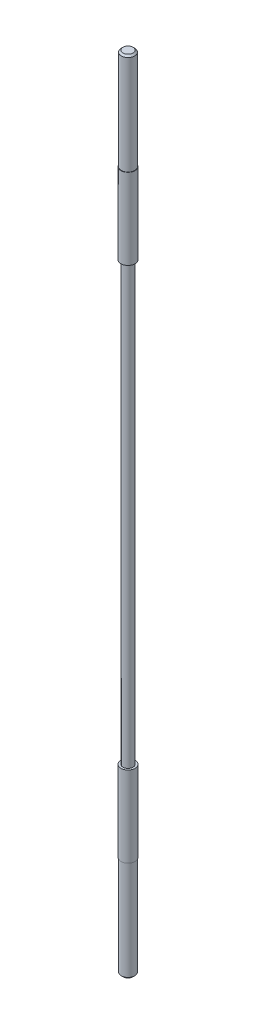
ISO-10303-21;
HEADER;
FILE_DESCRIPTION(('STEP AP214'),'2;1');
FILE_NAME('part.step','',(''),(''),'','','');
FILE_SCHEMA(('AUTOMOTIVE_DESIGN { 1 0 10303 214 1 1 1 1 }'));
ENDSEC;
DATA;
#1=APPLICATION_CONTEXT('core data for automotive mechanical design processes');
#2=APPLICATION_PROTOCOL_DEFINITION('international standard','automotive_design',2000,#1);
#3=PRODUCT_CONTEXT('',#1,'mechanical');
#4=PRODUCT('Part','Part','',(#3));
#5=PRODUCT_RELATED_PRODUCT_CATEGORY('part','',(#4));
#6=PRODUCT_DEFINITION_FORMATION('','',#4);
#7=PRODUCT_DEFINITION_CONTEXT('part definition',#1,'design');
#8=PRODUCT_DEFINITION('design','',#6,#7);
#9=PRODUCT_DEFINITION_SHAPE('','',#8);
#10=(LENGTH_UNIT() NAMED_UNIT(*) SI_UNIT(.MILLI.,.METRE.));
#11=(NAMED_UNIT(*) PLANE_ANGLE_UNIT() SI_UNIT($,.RADIAN.));
#12=(NAMED_UNIT(*) SI_UNIT($,.STERADIAN.) SOLID_ANGLE_UNIT());
#13=UNCERTAINTY_MEASURE_WITH_UNIT(LENGTH_MEASURE(1.E-05),#10,'distance_accuracy_value','');
#14=(GEOMETRIC_REPRESENTATION_CONTEXT(3) GLOBAL_UNCERTAINTY_ASSIGNED_CONTEXT((#13)) GLOBAL_UNIT_ASSIGNED_CONTEXT((#10,
#11,#12)) REPRESENTATION_CONTEXT('',''));
#15=CARTESIAN_POINT('',(0.,0.,0.));
#16=DIRECTION('',(0.,0.,1.));
#17=DIRECTION('',(1.,0.,0.));
#18=AXIS2_PLACEMENT_3D('',#15,#16,#17);
#19=CARTESIAN_POINT('',(0.,0.,0.));
#20=DIRECTION('',(0.,-1.,0.));
#21=DIRECTION('',(0.,0.,-1.));
#22=AXIS2_PLACEMENT_3D('',#19,#20,#21);
#23=PLANE('',#22);
#24=CARTESIAN_POINT('',(0.,0.,0.));
#25=DIRECTION('',(0.,-1.,0.));
#26=DIRECTION('',(0.,0.,-1.));
#27=AXIS2_PLACEMENT_3D('',#24,#25,#26);
#28=CIRCLE('',#27,1.49999999999997);
#29=CARTESIAN_POINT('',(0.,0.,-1.49999999999997));
#30=VERTEX_POINT('',#29);
#31=EDGE_CURVE('E10',#30,#30,#28,.F.);
#32=ORIENTED_EDGE('',*,*,#31,.T.);
#33=EDGE_LOOP('',(#32));
#34=FACE_BOUND('',#33,.T.);
#35=ADVANCED_FACE('F32',(#34),#23,.F.);
#36=CARTESIAN_POINT('',(0.,0.,0.));
#37=DIRECTION('',(0.,-1.,0.));
#38=DIRECTION('',(0.,0.,-1.));
#39=AXIS2_PLACEMENT_3D('',#36,#37,#38);
#40=CYLINDRICAL_SURFACE('',#39,2.);
#41=CARTESIAN_POINT('',(0.,-0.500000000000018,0.));
#42=DIRECTION('',(0.,-1.,0.));
#43=DIRECTION('',(0.,0.,-1.));
#44=AXIS2_PLACEMENT_3D('',#41,#42,#43);
#45=CIRCLE('',#44,2.);
#46=CARTESIAN_POINT('',(0.,-0.500000000000018,-2.));
#47=VERTEX_POINT('',#46);
#48=EDGE_CURVE('E39',#47,#47,#45,.T.);
#49=ORIENTED_EDGE('',*,*,#48,.T.);
#50=EDGE_LOOP('',(#49));
#51=FACE_BOUND('',#50,.T.);
#52=CARTESIAN_POINT('',(0.,-30.,0.));
#53=DIRECTION('',(0.,-1.,0.));
#54=DIRECTION('',(0.,0.,-1.));
#55=AXIS2_PLACEMENT_3D('',#52,#53,#54);
#56=CIRCLE('',#55,2.);
#57=CARTESIAN_POINT('',(0.,-30.,-2.));
#58=VERTEX_POINT('',#57);
#59=EDGE_CURVE('E52',#58,#58,#56,.T.);
#60=ORIENTED_EDGE('',*,*,#59,.F.);
#61=EDGE_LOOP('',(#60));
#62=FACE_BOUND('',#61,.T.);
#63=ADVANCED_FACE('F118',(#51,#62),#40,.T.);
#64=CARTESIAN_POINT('',(0.,-30.,2.));
#65=DIRECTION('',(0.,-1.,0.));
#66=DIRECTION('',(0.,0.,-1.));
#67=AXIS2_PLACEMENT_3D('',#64,#65,#66);
#68=PLANE('',#67);
#69=CARTESIAN_POINT('',(0.,-30.,0.));
#70=DIRECTION('',(0.,-1.,0.));
#71=DIRECTION('',(0.,0.,-1.));
#72=AXIS2_PLACEMENT_3D('',#69,#70,#71);
#73=CIRCLE('',#72,2.1);
#74=CARTESIAN_POINT('',(0.,-30.,-2.1));
#75=VERTEX_POINT('',#74);
#76=EDGE_CURVE('E55',#75,#75,#73,.T.);
#77=ORIENTED_EDGE('',*,*,#76,.F.);
#78=EDGE_LOOP('',(#77));
#79=FACE_BOUND('',#78,.T.);
#80=ORIENTED_EDGE('',*,*,#59,.T.);
#81=EDGE_LOOP('',(#80));
#82=FACE_BOUND('',#81,.T.);
#83=ADVANCED_FACE('F112',(#79,#82),#68,.F.);
#84=CARTESIAN_POINT('',(0.,0.,0.));
#85=DIRECTION('',(0.,-1.,0.));
#86=DIRECTION('',(0.,0.,-1.));
#87=AXIS2_PLACEMENT_3D('',#84,#85,#86);
#88=CYLINDRICAL_SURFACE('',#87,2.09999999999999);
#89=CARTESIAN_POINT('',(0.,-54.,0.));
#90=DIRECTION('',(0.,-1.,0.));
#91=DIRECTION('',(0.,0.,-1.));
#92=AXIS2_PLACEMENT_3D('',#89,#90,#91);
#93=CIRCLE('',#92,2.09999999999999);
#94=CARTESIAN_POINT('',(0.,-54.,-2.09999999999999));
#95=VERTEX_POINT('',#94);
#96=EDGE_CURVE('E58',#95,#95,#93,.T.);
#97=ORIENTED_EDGE('',*,*,#96,.F.);
#98=EDGE_LOOP('',(#97));
#99=FACE_BOUND('',#98,.T.);
#100=ORIENTED_EDGE('',*,*,#76,.T.);
#101=EDGE_LOOP('',(#100));
#102=FACE_BOUND('',#101,.T.);
#103=ADVANCED_FACE('F106',(#99,#102),#88,.T.);
#104=CARTESIAN_POINT('',(0.,-54.,2.09999999999999));
#105=DIRECTION('',(0.,1.,0.));
#106=DIRECTION('',(0.,0.,1.));
#107=AXIS2_PLACEMENT_3D('',#104,#105,#106);
#108=PLANE('',#107);
#109=CARTESIAN_POINT('',(0.,-54.,0.));
#110=DIRECTION('',(0.,-1.,0.));
#111=DIRECTION('',(0.,0.,-1.));
#112=AXIS2_PLACEMENT_3D('',#109,#110,#111);
#113=CIRCLE('',#112,1.5);
#114=CARTESIAN_POINT('',(0.,-54.,-1.5));
#115=VERTEX_POINT('',#114);
#116=EDGE_CURVE('E61',#115,#115,#113,.T.);
#117=ORIENTED_EDGE('',*,*,#116,.F.);
#118=EDGE_LOOP('',(#117));
#119=FACE_BOUND('',#118,.T.);
#120=ORIENTED_EDGE('',*,*,#96,.T.);
#121=EDGE_LOOP('',(#120));
#122=FACE_BOUND('',#121,.T.);
#123=ADVANCED_FACE('F100',(#119,#122),#108,.F.);
#124=CARTESIAN_POINT('',(0.,0.,0.));
#125=DIRECTION('',(0.,-1.,0.));
#126=DIRECTION('',(0.,0.,-1.));
#127=AXIS2_PLACEMENT_3D('',#124,#125,#126);
#128=CYLINDRICAL_SURFACE('',#127,1.49999999999999);
#129=CARTESIAN_POINT('',(0.,-184.,0.));
#130=DIRECTION('',(0.,-1.,0.));
#131=DIRECTION('',(0.,0.,-1.));
#132=AXIS2_PLACEMENT_3D('',#129,#130,#131);
#133=CIRCLE('',#132,1.49999999999998);
#134=CARTESIAN_POINT('',(0.,-184.,-1.49999999999998));
#135=VERTEX_POINT('',#134);
#136=EDGE_CURVE('E64',#135,#135,#133,.T.);
#137=ORIENTED_EDGE('',*,*,#136,.F.);
#138=EDGE_LOOP('',(#137));
#139=FACE_BOUND('',#138,.T.);
#140=ORIENTED_EDGE('',*,*,#116,.T.);
#141=EDGE_LOOP('',(#140));
#142=FACE_BOUND('',#141,.T.);
#143=ADVANCED_FACE('F94',(#139,#142),#128,.T.);
#144=CARTESIAN_POINT('',(0.,-184.,1.49999999999998));
#145=DIRECTION('',(0.,-1.,0.));
#146=DIRECTION('',(0.,0.,-1.));
#147=AXIS2_PLACEMENT_3D('',#144,#145,#146);
#148=PLANE('',#147);
#149=CARTESIAN_POINT('',(0.,-184.,0.));
#150=DIRECTION('',(0.,-1.,0.));
#151=DIRECTION('',(0.,0.,-1.));
#152=AXIS2_PLACEMENT_3D('',#149,#150,#151);
#153=CIRCLE('',#152,2.09999999999998);
#154=CARTESIAN_POINT('',(0.,-184.,-2.09999999999998));
#155=VERTEX_POINT('',#154);
#156=EDGE_CURVE('E67',#155,#155,#153,.T.);
#157=ORIENTED_EDGE('',*,*,#156,.F.);
#158=EDGE_LOOP('',(#157));
#159=FACE_BOUND('',#158,.T.);
#160=ORIENTED_EDGE('',*,*,#136,.T.);
#161=EDGE_LOOP('',(#160));
#162=FACE_BOUND('',#161,.T.);
#163=ADVANCED_FACE('F88',(#159,#162),#148,.F.);
#164=CARTESIAN_POINT('',(0.,0.,0.));
#165=DIRECTION('',(0.,-1.,0.));
#166=DIRECTION('',(0.,0.,-1.));
#167=AXIS2_PLACEMENT_3D('',#164,#165,#166);
#168=CYLINDRICAL_SURFACE('',#167,2.09999999999998);
#169=CARTESIAN_POINT('',(0.,-208.,0.));
#170=DIRECTION('',(0.,-1.,0.));
#171=DIRECTION('',(0.,0.,-1.));
#172=AXIS2_PLACEMENT_3D('',#169,#170,#171);
#173=CIRCLE('',#172,2.09999999999997);
#174=CARTESIAN_POINT('',(0.,-208.,-2.09999999999997));
#175=VERTEX_POINT('',#174);
#176=EDGE_CURVE('E70',#175,#175,#173,.T.);
#177=ORIENTED_EDGE('',*,*,#176,.F.);
#178=EDGE_LOOP('',(#177));
#179=FACE_BOUND('',#178,.T.);
#180=ORIENTED_EDGE('',*,*,#156,.T.);
#181=EDGE_LOOP('',(#180));
#182=FACE_BOUND('',#181,.T.);
#183=ADVANCED_FACE('F82',(#179,#182),#168,.T.);
#184=CARTESIAN_POINT('',(0.,-208.,2.09999999999997));
#185=DIRECTION('',(0.,1.,0.));
#186=DIRECTION('',(0.,0.,1.));
#187=AXIS2_PLACEMENT_3D('',#184,#185,#186);
#188=PLANE('',#187);
#189=CARTESIAN_POINT('',(0.,-208.,0.));
#190=DIRECTION('',(0.,-1.,0.));
#191=DIRECTION('',(0.,0.,-1.));
#192=AXIS2_PLACEMENT_3D('',#189,#190,#191);
#193=CIRCLE('',#192,1.99999999999997);
#194=CARTESIAN_POINT('',(0.,-208.,-1.99999999999997));
#195=VERTEX_POINT('',#194);
#196=EDGE_CURVE('E73',#195,#195,#193,.T.);
#197=ORIENTED_EDGE('',*,*,#196,.F.);
#198=EDGE_LOOP('',(#197));
#199=FACE_BOUND('',#198,.T.);
#200=ORIENTED_EDGE('',*,*,#176,.T.);
#201=EDGE_LOOP('',(#200));
#202=FACE_BOUND('',#201,.T.);
#203=ADVANCED_FACE('F79',(#199,#202),#188,.F.);
#204=CARTESIAN_POINT('',(0.,0.,0.));
#205=DIRECTION('',(0.,-1.,0.));
#206=DIRECTION('',(0.,0.,-1.));
#207=AXIS2_PLACEMENT_3D('',#204,#205,#206);
#208=CYLINDRICAL_SURFACE('',#207,1.99999999999997);
#209=CARTESIAN_POINT('',(0.,-237.5,0.));
#210=DIRECTION('',(0.,1.,0.));
#211=DIRECTION('',(0.,0.,1.));
#212=AXIS2_PLACEMENT_3D('',#209,#210,#211);
#213=CIRCLE('',#212,1.99999999999997);
#214=CARTESIAN_POINT('',(0.,-237.5,1.99999999999997));
#215=VERTEX_POINT('',#214);
#216=EDGE_CURVE('E43',#215,#215,#213,.T.);
#217=ORIENTED_EDGE('',*,*,#216,.T.);
#218=EDGE_LOOP('',(#217));
#219=FACE_BOUND('',#218,.T.);
#220=ORIENTED_EDGE('',*,*,#196,.T.);
#221=EDGE_LOOP('',(#220));
#222=FACE_BOUND('',#221,.T.);
#223=ADVANCED_FACE('F77',(#219,#222),#208,.T.);
#224=CARTESIAN_POINT('',(0.,-238.,1.99999999999997));
#225=DIRECTION('',(0.,1.,0.));
#226=DIRECTION('',(0.,0.,1.));
#227=AXIS2_PLACEMENT_3D('',#224,#225,#226);
#228=PLANE('',#227);
#229=CARTESIAN_POINT('',(0.,-238.,0.));
#230=DIRECTION('',(0.,1.,0.));
#231=DIRECTION('',(0.,0.,1.));
#232=AXIS2_PLACEMENT_3D('',#229,#230,#231);
#233=CIRCLE('',#232,1.49999999999997);
#234=CARTESIAN_POINT('',(0.,-238.,1.49999999999997));
#235=VERTEX_POINT('',#234);
#236=EDGE_CURVE('E47',#235,#235,#233,.F.);
#237=ORIENTED_EDGE('',*,*,#236,.T.);
#238=EDGE_LOOP('',(#237));
#239=FACE_BOUND('',#238,.T.);
#240=ADVANCED_FACE('F130',(#239),#228,.F.);
#241=CARTESIAN_POINT('',(0.,-238.,0.));
#242=DIRECTION('',(0.,1.,0.));
#243=DIRECTION('',(0.,0.,1.));
#244=AXIS2_PLACEMENT_3D('',#241,#242,#243);
#245=CONICAL_SURFACE('',#244,1.49999999999997,0.785398163397474);
#246=ORIENTED_EDGE('',*,*,#216,.F.);
#247=EDGE_LOOP('',(#246));
#248=FACE_BOUND('',#247,.T.);
#249=ORIENTED_EDGE('',*,*,#236,.F.);
#250=EDGE_LOOP('',(#249));
#251=FACE_BOUND('',#250,.T.);
#252=ADVANCED_FACE('F128',(#248,#251),#245,.T.);
#253=CARTESIAN_POINT('',(0.,-0.500000000000018,0.));
#254=DIRECTION('',(0.,-1.,0.));
#255=DIRECTION('',(0.,0.,-1.));
#256=AXIS2_PLACEMENT_3D('',#253,#254,#255);
#257=CONICAL_SURFACE('',#256,2.,0.785398163397455);
#258=ORIENTED_EDGE('',*,*,#31,.F.);
#259=EDGE_LOOP('',(#258));
#260=FACE_BOUND('',#259,.T.);
#261=ORIENTED_EDGE('',*,*,#48,.F.);
#262=EDGE_LOOP('',(#261));
#263=FACE_BOUND('',#262,.T.);
#264=ADVANCED_FACE('F34',(#260,#263),#257,.T.);
#265=CLOSED_SHELL('',(#35,#63,#83,#103,#123,#143,#163,#183,#203,#223,#240,#252,#264));
#266=MANIFOLD_SOLID_BREP('B2',#265);
#267=ADVANCED_BREP_SHAPE_REPRESENTATION('',(#18,#266),#14);
#268=SHAPE_DEFINITION_REPRESENTATION(#9,#267);
ENDSEC;
END-ISO-10303-21;
